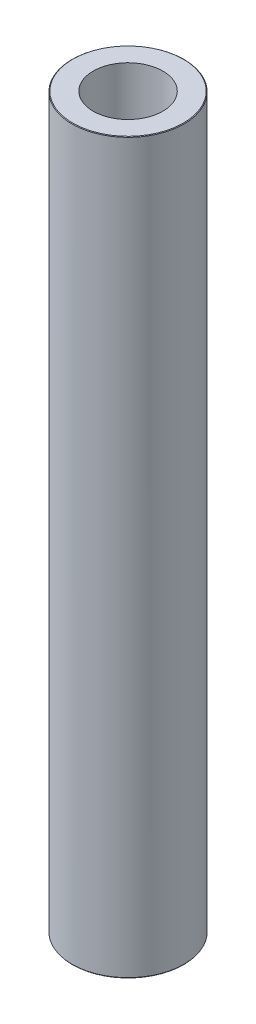
ISO-10303-21;
HEADER;
FILE_DESCRIPTION(('STEP AP214'),'2;1');
FILE_NAME('part.step','',(''),(''),'','','');
FILE_SCHEMA(('AUTOMOTIVE_DESIGN { 1 0 10303 214 1 1 1 1 }'));
ENDSEC;
DATA;
#1=APPLICATION_CONTEXT('core data for automotive mechanical design processes');
#2=APPLICATION_PROTOCOL_DEFINITION('international standard','automotive_design',2000,#1);
#3=PRODUCT_CONTEXT('',#1,'mechanical');
#4=PRODUCT('Part','Part','',(#3));
#5=PRODUCT_RELATED_PRODUCT_CATEGORY('part','',(#4));
#6=PRODUCT_DEFINITION_FORMATION('','',#4);
#7=PRODUCT_DEFINITION_CONTEXT('part definition',#1,'design');
#8=PRODUCT_DEFINITION('design','',#6,#7);
#9=PRODUCT_DEFINITION_SHAPE('','',#8);
#10=(LENGTH_UNIT() NAMED_UNIT(*) SI_UNIT(.MILLI.,.METRE.));
#11=(NAMED_UNIT(*) PLANE_ANGLE_UNIT() SI_UNIT($,.RADIAN.));
#12=(NAMED_UNIT(*) SI_UNIT($,.STERADIAN.) SOLID_ANGLE_UNIT());
#13=UNCERTAINTY_MEASURE_WITH_UNIT(LENGTH_MEASURE(1.E-05),#10,'distance_accuracy_value','');
#14=(GEOMETRIC_REPRESENTATION_CONTEXT(3) GLOBAL_UNCERTAINTY_ASSIGNED_CONTEXT((#13)) GLOBAL_UNIT_ASSIGNED_CONTEXT((#10,
#11,#12)) REPRESENTATION_CONTEXT('',''));
#15=CARTESIAN_POINT('',(0.,0.,0.));
#16=DIRECTION('',(0.,0.,1.));
#17=DIRECTION('',(1.,0.,0.));
#18=AXIS2_PLACEMENT_3D('',#15,#16,#17);
#19=CARTESIAN_POINT('',(0.,455.618633308029,0.));
#20=DIRECTION('',(0.,-1.,0.));
#21=DIRECTION('',(0.,0.,-1.));
#22=AXIS2_PLACEMENT_3D('',#19,#20,#21);
#23=CYLINDRICAL_SURFACE('',#22,35.);
#24=CARTESIAN_POINT('',(0.,455.310637101333,0.));
#25=DIRECTION('',(0.,1.,0.));
#26=DIRECTION('',(0.,0.,1.));
#27=AXIS2_PLACEMENT_3D('',#24,#25,#26);
#28=CIRCLE('',#27,35.);
#29=CARTESIAN_POINT('',(0.,455.310637101332,-35.));
#30=VERTEX_POINT('',#29);
#31=EDGE_CURVE('E50',#30,#30,#28,.F.);
#32=CARTESIAN_POINT('',(0.,0.41002241826249,0.));
#33=DIRECTION('',(0.,1.,0.));
#34=DIRECTION('',(0.,0.,1.));
#35=AXIS2_PLACEMENT_3D('',#32,#33,#34);
#36=CIRCLE('',#35,35.);
#37=CARTESIAN_POINT('',(0.,0.410022418262435,-35.));
#38=VERTEX_POINT('',#37);
#39=EDGE_CURVE('E51',#38,#38,#36,.T.);
#40=CARTESIAN_POINT('',(0.,455.310637101332,-35.));
#41=CARTESIAN_POINT('',(0.,450.572089031717,-35.));
#42=CARTESIAN_POINT('',(0.,445.833540962102,-35.));
#43=CARTESIAN_POINT('',(0.,436.356444822871,-35.));
#44=CARTESIAN_POINT('',(0.,431.617896753256,-35.));
#45=CARTESIAN_POINT('',(0.,422.140800614025,-35.));
#46=CARTESIAN_POINT('',(0.,417.40225254441,-35.));
#47=CARTESIAN_POINT('',(0.,407.925156405179,-35.));
#48=CARTESIAN_POINT('',(0.,403.186608335564,-35.));
#49=CARTESIAN_POINT('',(0.,393.709512196333,-35.));
#50=CARTESIAN_POINT('',(0.,388.970964126718,-35.));
#51=CARTESIAN_POINT('',(0.,379.493867987487,-35.));
#52=CARTESIAN_POINT('',(0.,374.755319917872,-35.));
#53=CARTESIAN_POINT('',(0.,365.278223778642,-35.));
#54=CARTESIAN_POINT('',(0.,360.539675709026,-35.));
#55=CARTESIAN_POINT('',(0.,351.062579569796,-35.));
#56=CARTESIAN_POINT('',(0.,346.32403150018,-35.));
#57=CARTESIAN_POINT('',(0.,336.84693536095,-35.));
#58=CARTESIAN_POINT('',(0.,332.108387291334,-35.));
#59=CARTESIAN_POINT('',(0.,322.631291152104,-35.));
#60=CARTESIAN_POINT('',(0.,317.892743082488,-35.));
#61=CARTESIAN_POINT('',(0.,308.415646943258,-35.));
#62=CARTESIAN_POINT('',(0.,303.677098873642,-35.));
#63=CARTESIAN_POINT('',(0.,294.200002734412,-35.));
#64=CARTESIAN_POINT('',(0.,289.461454664797,-35.));
#65=CARTESIAN_POINT('',(0.,279.984358525566,-35.));
#66=CARTESIAN_POINT('',(0.,275.245810455951,-35.));
#67=CARTESIAN_POINT('',(0.,265.76871431672,-35.));
#68=CARTESIAN_POINT('',(0.,261.030166247105,-35.));
#69=CARTESIAN_POINT('',(0.,251.553070107874,-35.));
#70=CARTESIAN_POINT('',(0.,246.814522038259,-35.));
#71=CARTESIAN_POINT('',(0.,237.337425899028,-35.));
#72=CARTESIAN_POINT('',(0.,232.598877829413,-35.));
#73=CARTESIAN_POINT('',(0.,223.121781690182,-35.));
#74=CARTESIAN_POINT('',(0.,218.383233620567,-35.));
#75=CARTESIAN_POINT('',(0.,208.906137481336,-35.));
#76=CARTESIAN_POINT('',(0.,204.167589411721,-35.));
#77=CARTESIAN_POINT('',(0.,194.69049327249,-35.));
#78=CARTESIAN_POINT('',(0.,189.951945202875,-35.));
#79=CARTESIAN_POINT('',(0.,180.474849063644,-35.));
#80=CARTESIAN_POINT('',(0.,175.736300994029,-35.));
#81=CARTESIAN_POINT('',(0.,166.259204854798,-35.));
#82=CARTESIAN_POINT('',(0.,161.520656785183,-35.));
#83=CARTESIAN_POINT('',(0.,152.043560645952,-35.));
#84=CARTESIAN_POINT('',(0.,147.305012576337,-35.));
#85=CARTESIAN_POINT('',(0.,137.827916437106,-35.));
#86=CARTESIAN_POINT('',(0.,133.089368367491,-35.));
#87=CARTESIAN_POINT('',(0.,123.612272228261,-35.));
#88=CARTESIAN_POINT('',(0.,118.873724158645,-35.));
#89=CARTESIAN_POINT('',(0.,109.396628019415,-35.));
#90=CARTESIAN_POINT('',(0.,104.658079949799,-35.));
#91=CARTESIAN_POINT('',(0.,95.1809838105687,-35.));
#92=CARTESIAN_POINT('',(0.,90.4424357409534,-35.));
#93=CARTESIAN_POINT('',(0.,80.9653396017227,-35.));
#94=CARTESIAN_POINT('',(0.,76.2267915321074,-35.));
#95=CARTESIAN_POINT('',(0.,66.7496953928768,-35.));
#96=CARTESIAN_POINT('',(0.,62.0111473232615,-35.));
#97=CARTESIAN_POINT('',(0.,52.5340511840309,-35.));
#98=CARTESIAN_POINT('',(0.,47.7955031144156,-35.));
#99=CARTESIAN_POINT('',(0.,38.3184069751849,-35.));
#100=CARTESIAN_POINT('',(0.,33.5798589055696,-35.));
#101=CARTESIAN_POINT('',(0.,24.102762766339,-35.));
#102=CARTESIAN_POINT('',(0.,19.3642146967237,-35.));
#103=CARTESIAN_POINT('',(0.,9.88711855749304,-35.));
#104=CARTESIAN_POINT('',(0.,5.14857048787774,-35.));
#105=CARTESIAN_POINT('',(0.,0.410022418262435,-35.));
#106=B_SPLINE_CURVE_WITH_KNOTS('',3,(#40,#41,#42,#43,#44,#45,#46,#47,#48,#49,#50,#51,#52,#53,
#54,#55,#56,#57,#58,#59,#60,#61,#62,#63,#64,#65,#66,#67,#68,#69,#70,#71,#72,#73,#74,#75,#76,#77,
#78,#79,#80,#81,#82,#83,#84,#85,#86,#87,#88,#89,#90,#91,#92,#93,#94,#95,#96,#97,#98,#99,#100,
#101,#102,#103,#104,#105),.UNSPECIFIED.,.F.,.F.,(4,2,2,2,2,2,2,2,2,2,2,2,2,2,2,2,2,2,2,2,2,2,2,
2,2,2,2,2,2,2,2,2,4),(0.,14.2156442088459,28.4312884176918,42.6469326265378,56.8625768353838,
71.0782210442297,85.2938652530756,99.5095094619216,113.725153670768,127.940797879613,
142.156442088459,156.372086297305,170.587730506151,184.803374714997,199.019018923843,
213.234663132689,227.450307341535,241.665951550381,255.881595759227,270.097239968073,
284.312884176919,298.528528385765,312.744172594611,326.959816803457,341.175461012302,
355.391105221148,369.606749429994,383.82239363884,398.038037847686,412.253682056532,
426.469326265378,440.684970474224,454.90061468307),.UNSPECIFIED.);
#107=EDGE_CURVE('BSEAM39',#30,#38,#106,.T.);
#108=ORIENTED_EDGE('',*,*,#31,.T.);
#109=ORIENTED_EDGE('',*,*,#39,.T.);
#110=ORIENTED_EDGE('',*,*,#107,.T.);
#111=ORIENTED_EDGE('',*,*,#107,.F.);
#112=EDGE_LOOP('',(#108,#110,#109,#111));
#113=FACE_BOUND('',#112,.T.);
#114=ADVANCED_FACE('F39',(#113),#23,.T.);
#115=CARTESIAN_POINT('',(0.,455.618633308029,0.));
#116=DIRECTION('',(0.,1.,0.));
#117=DIRECTION('',(0.,0.,1.));
#118=AXIS2_PLACEMENT_3D('',#115,#116,#117);
#119=PLANE('',#118);
#120=CARTESIAN_POINT('',(0.,455.618633308029,0.));
#121=DIRECTION('',(0.,1.,0.));
#122=DIRECTION('',(0.,0.,1.));
#123=AXIS2_PLACEMENT_3D('',#120,#121,#122);
#124=CIRCLE('',#123,34.5899775817373);
#125=CARTESIAN_POINT('',(0.,455.618633308028,-34.5899775817374));
#126=VERTEX_POINT('',#125);
#127=EDGE_CURVE('E54',#126,#126,#124,.T.);
#128=ORIENTED_EDGE('',*,*,#127,.T.);
#129=EDGE_LOOP('',(#128));
#130=FACE_BOUND('',#129,.T.);
#131=CARTESIAN_POINT('',(0.,455.618633308029,0.));
#132=DIRECTION('',(0.,1.,0.));
#133=DIRECTION('',(0.,0.,1.));
#134=AXIS2_PLACEMENT_3D('',#131,#132,#133);
#135=CIRCLE('',#134,21.7672789513396);
#136=CARTESIAN_POINT('',(0.,455.618633308029,21.7672789513396));
#137=VERTEX_POINT('',#136);
#138=EDGE_CURVE('E58',#137,#137,#135,.T.);
#139=ORIENTED_EDGE('',*,*,#138,.F.);
#140=EDGE_LOOP('',(#139));
#141=FACE_BOUND('',#140,.T.);
#142=ADVANCED_FACE('F69',(#130,#141),#119,.T.);
#143=CARTESIAN_POINT('',(0.,0.,0.));
#144=DIRECTION('',(0.,1.,0.));
#145=DIRECTION('',(0.,0.,1.));
#146=AXIS2_PLACEMENT_3D('',#143,#144,#145);
#147=PLANE('',#146);
#148=CARTESIAN_POINT('',(0.,0.,0.));
#149=DIRECTION('',(0.,1.,0.));
#150=DIRECTION('',(0.,0.,1.));
#151=AXIS2_PLACEMENT_3D('',#148,#149,#150);
#152=CIRCLE('',#151,34.6920037933041);
#153=CARTESIAN_POINT('',(0.,0.,34.6920037933041));
#154=VERTEX_POINT('',#153);
#155=EDGE_CURVE('E10',#154,#154,#152,.F.);
#156=ORIENTED_EDGE('',*,*,#155,.T.);
#157=EDGE_LOOP('',(#156));
#158=FACE_BOUND('',#157,.T.);
#159=CARTESIAN_POINT('',(0.,0.,0.));
#160=DIRECTION('',(0.,1.,0.));
#161=DIRECTION('',(0.,0.,1.));
#162=AXIS2_PLACEMENT_3D('',#159,#160,#161);
#163=CIRCLE('',#162,21.7672789513396);
#164=CARTESIAN_POINT('',(0.,0.,21.7672789513396));
#165=VERTEX_POINT('',#164);
#166=EDGE_CURVE('E63',#165,#165,#163,.T.);
#167=ORIENTED_EDGE('',*,*,#166,.T.);
#168=EDGE_LOOP('',(#167));
#169=FACE_BOUND('',#168,.T.);
#170=ADVANCED_FACE('F75',(#158,#169),#147,.F.);
#171=CARTESIAN_POINT('',(0.,455.618633308029,0.));
#172=DIRECTION('',(0.,-1.,0.));
#173=DIRECTION('',(0.,0.,-1.));
#174=AXIS2_PLACEMENT_3D('',#171,#172,#173);
#175=CYLINDRICAL_SURFACE('',#174,21.7672789513396);
#176=ORIENTED_EDGE('',*,*,#138,.T.);
#177=EDGE_LOOP('',(#176));
#178=FACE_BOUND('',#177,.T.);
#179=ORIENTED_EDGE('',*,*,#166,.F.);
#180=EDGE_LOOP('',(#179));
#181=FACE_BOUND('',#180,.T.);
#182=ADVANCED_FACE('F70',(#178,#181),#175,.F.);
#183=CARTESIAN_POINT('',(0.,455.618633308029,0.));
#184=DIRECTION('',(0.,-1.,0.));
#185=DIRECTION('',(0.,0.,-1.));
#186=AXIS2_PLACEMENT_3D('',#183,#184,#185);
#187=CONICAL_SURFACE('',#186,34.5899775817373,0.92654735798367);
#188=CARTESIAN_POINT('',(0.,455.310637101333,-35.));
#189=CARTESIAN_POINT('',(0.,455.313845395152,-34.9957289331431));
#190=CARTESIAN_POINT('',(0.,455.317053688972,-34.9914578662862));
#191=CARTESIAN_POINT('',(0.,455.323470276611,-34.9829157325724));
#192=CARTESIAN_POINT('',(0.,455.326678570431,-34.9786446657155));
#193=CARTESIAN_POINT('',(0.,455.333095158071,-34.9701025320017));
#194=CARTESIAN_POINT('',(0.,455.33630345189,-34.9658314651448));
#195=CARTESIAN_POINT('',(0.,455.34272003953,-34.957289331431));
#196=CARTESIAN_POINT('',(0.,455.34592833335,-34.9530182645741));
#197=CARTESIAN_POINT('',(0.,455.352344920989,-34.9444761308603));
#198=CARTESIAN_POINT('',(0.,455.355553214809,-34.9402050640034));
#199=CARTESIAN_POINT('',(0.,455.361969802448,-34.9316629302896));
#200=CARTESIAN_POINT('',(0.,455.365178096268,-34.9273918634327));
#201=CARTESIAN_POINT('',(0.,455.371594683908,-34.9188497297189));
#202=CARTESIAN_POINT('',(0.,455.374802977727,-34.914578662862));
#203=CARTESIAN_POINT('',(0.,455.381219565367,-34.9060365291482));
#204=CARTESIAN_POINT('',(0.,455.384427859187,-34.9017654622913));
#205=CARTESIAN_POINT('',(0.,455.390844446826,-34.8932233285775));
#206=CARTESIAN_POINT('',(0.,455.394052740646,-34.8889522617206));
#207=CARTESIAN_POINT('',(0.,455.400469328286,-34.8804101280068));
#208=CARTESIAN_POINT('',(0.,455.403677622105,-34.8761390611499));
#209=CARTESIAN_POINT('',(0.,455.410094209745,-34.8675969274361));
#210=CARTESIAN_POINT('',(0.,455.413302503564,-34.8633258605791));
#211=CARTESIAN_POINT('',(0.,455.419719091204,-34.8547837268653));
#212=CARTESIAN_POINT('',(0.,455.422927385024,-34.8505126600084));
#213=CARTESIAN_POINT('',(0.,455.429343972663,-34.8419705262946));
#214=CARTESIAN_POINT('',(0.,455.432552266483,-34.8376994594377));
#215=CARTESIAN_POINT('',(0.,455.438968854122,-34.8291573257239));
#216=CARTESIAN_POINT('',(0.,455.442177147942,-34.824886258867));
#217=CARTESIAN_POINT('',(0.,455.448593735582,-34.8163441251532));
#218=CARTESIAN_POINT('',(0.,455.451802029402,-34.8120730582963));
#219=CARTESIAN_POINT('',(0.,455.458218617041,-34.8035309245825));
#220=CARTESIAN_POINT('',(0.,455.461426910861,-34.7992598577256));
#221=CARTESIAN_POINT('',(0.,455.4678434985,-34.7907177240118));
#222=CARTESIAN_POINT('',(0.,455.47105179232,-34.7864466571549));
#223=CARTESIAN_POINT('',(0.,455.477468379959,-34.7779045234411));
#224=CARTESIAN_POINT('',(0.,455.480676673779,-34.7736334565842));
#225=CARTESIAN_POINT('',(0.,455.487093261419,-34.7650913228704));
#226=CARTESIAN_POINT('',(0.,455.490301555238,-34.7608202560135));
#227=CARTESIAN_POINT('',(0.,455.496718142878,-34.7522781222997));
#228=CARTESIAN_POINT('',(0.,455.499926436698,-34.7480070554428));
#229=CARTESIAN_POINT('',(0.,455.506343024337,-34.739464921729));
#230=CARTESIAN_POINT('',(0.,455.509551318157,-34.7351938548721));
#231=CARTESIAN_POINT('',(0.,455.515967905796,-34.7266517211583));
#232=CARTESIAN_POINT('',(0.,455.519176199616,-34.7223806543013));
#233=CARTESIAN_POINT('',(0.,455.525592787256,-34.7138385205875));
#234=CARTESIAN_POINT('',(0.,455.528801081075,-34.7095674537306));
#235=CARTESIAN_POINT('',(0.,455.535217668715,-34.7010253200168));
#236=CARTESIAN_POINT('',(0.,455.538425962535,-34.6967542531599));
#237=CARTESIAN_POINT('',(0.,455.544842550174,-34.6882121194461));
#238=CARTESIAN_POINT('',(0.,455.548050843994,-34.6839410525892));
#239=CARTESIAN_POINT('',(0.,455.554467431633,-34.6753989188754));
#240=CARTESIAN_POINT('',(0.,455.557675725453,-34.6711278520185));
#241=CARTESIAN_POINT('',(0.,455.564092313093,-34.6625857183047));
#242=CARTESIAN_POINT('',(0.,455.567300606912,-34.6583146514478));
#243=CARTESIAN_POINT('',(0.,455.573717194552,-34.649772517734));
#244=CARTESIAN_POINT('',(0.,455.576925488372,-34.6455014508771));
#245=CARTESIAN_POINT('',(0.,455.583342076011,-34.6369593171633));
#246=CARTESIAN_POINT('',(0.,455.586550369831,-34.6326882503064));
#247=CARTESIAN_POINT('',(0.,455.59296695747,-34.6241461165926));
#248=CARTESIAN_POINT('',(0.,455.59617525129,-34.6198750497357));
#249=CARTESIAN_POINT('',(0.,455.60259183893,-34.6113329160219));
#250=CARTESIAN_POINT('',(0.,455.605800132749,-34.607061849165));
#251=CARTESIAN_POINT('',(0.,455.612216720389,-34.5985197154512));
#252=CARTESIAN_POINT('',(0.,455.615425014209,-34.5942486485942));
#253=CARTESIAN_POINT('',(0.,455.618633308029,-34.5899775817374));
#254=B_SPLINE_CURVE_WITH_KNOTS('',3,(#188,#189,#190,#191,#192,#193,#194,#195,#196,#197,#198,
#199,#200,#201,#202,#203,#204,#205,#206,#207,#208,#209,#210,#211,#212,#213,#214,#215,#216,#217,
#218,#219,#220,#221,#222,#223,#224,#225,#226,#227,#228,#229,#230,#231,#232,#233,#234,#235,#236,
#237,#238,#239,#240,#241,#242,#243,#244,#245,#246,#247,#248,#249,#250,#251,#252,#253),
.UNSPECIFIED.,.F.,.F.,(4,2,2,2,2,2,2,2,2,2,2,2,2,2,2,2,2,2,2,2,2,2,2,2,2,2,2,2,2,2,2,2,4),(0.,
0.0160254938135858,0.0320509876271716,0.0480764814407963,0.0641019752543821,0.0801274690680068,
0.0961529628815927,0.112178456695217,0.128203950508803,0.144229444322389,0.160254938136014,
0.176280431949599,0.192305925763224,0.20833141957681,0.224356913390429,0.24038240720402,
0.25640790101764,0.272433394831231,0.288458888644817,0.304484382458436,0.320509876272027,
0.336535370085646,0.352560863899238,0.368586357712857,0.384611851526443,0.400637345340034,
0.416662839153653,0.432688332967245,0.448713826780864,0.46473932059445,0.480764814408074,
0.49679030822166,0.512815802035285),.UNSPECIFIED.);
#255=EDGE_CURVE('BSEAM81',#30,#126,#254,.T.);
#256=ORIENTED_EDGE('',*,*,#31,.F.);
#257=ORIENTED_EDGE('',*,*,#127,.F.);
#258=ORIENTED_EDGE('',*,*,#255,.T.);
#259=ORIENTED_EDGE('',*,*,#255,.F.);
#260=EDGE_LOOP('',(#256,#258,#257,#259));
#261=FACE_BOUND('',#260,.T.);
#262=ADVANCED_FACE('F81',(#261),#187,.T.);
#263=CARTESIAN_POINT('',(0.,0.41002241826249,0.));
#264=DIRECTION('',(0.,1.,0.));
#265=DIRECTION('',(0.,0.,1.));
#266=AXIS2_PLACEMENT_3D('',#263,#264,#265);
#267=CONICAL_SURFACE('',#266,35.,0.644248968811344);
#268=ORIENTED_EDGE('',*,*,#155,.F.);
#269=EDGE_LOOP('',(#268));
#270=FACE_BOUND('',#269,.T.);
#271=ORIENTED_EDGE('',*,*,#39,.F.);
#272=EDGE_LOOP('',(#271));
#273=FACE_BOUND('',#272,.T.);
#274=ADVANCED_FACE('F45',(#270,#273),#267,.T.);
#275=CLOSED_SHELL('',(#114,#142,#170,#182,#262,#274));
#276=MANIFOLD_SOLID_BREP('B2',#275);
#277=ADVANCED_BREP_SHAPE_REPRESENTATION('',(#18,#276),#14);
#278=SHAPE_DEFINITION_REPRESENTATION(#9,#277);
ENDSEC;
END-ISO-10303-21;
